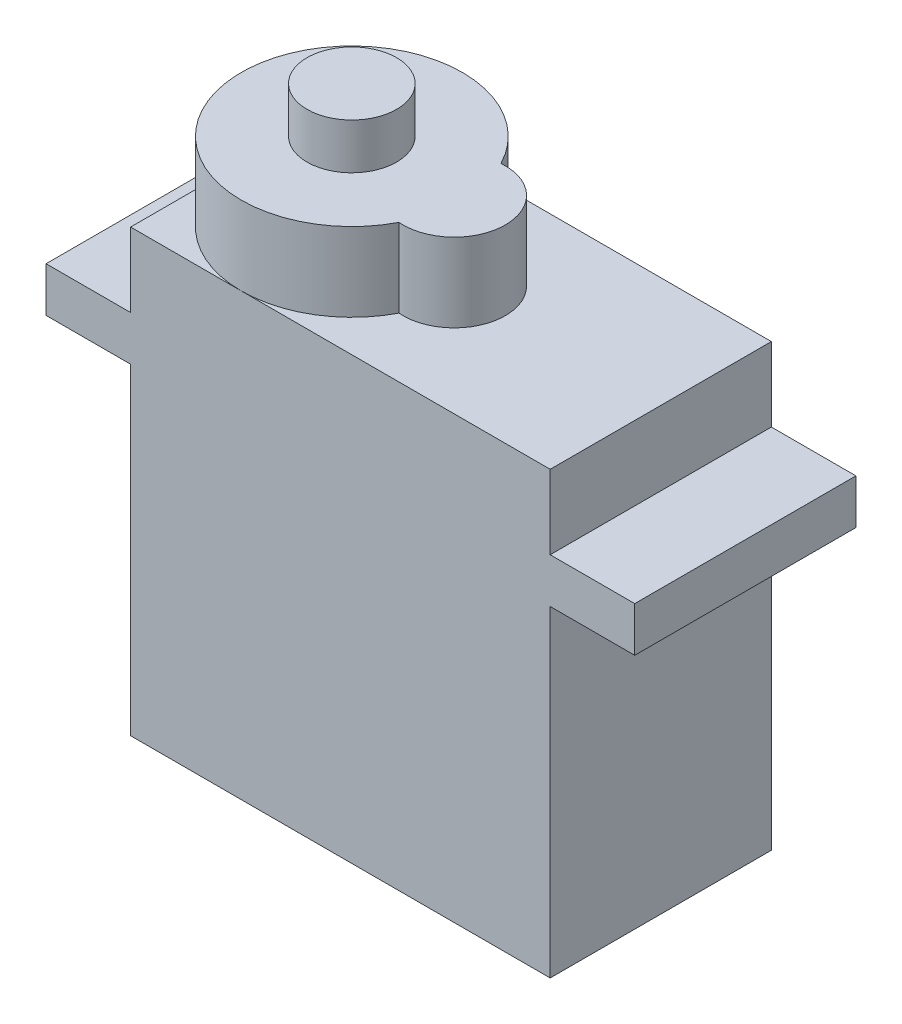
ISO-10303-21;
HEADER;
FILE_DESCRIPTION(('STEP AP214'),'2;1');
FILE_NAME('part.step','',(''),(''),'','','');
FILE_SCHEMA(('AUTOMOTIVE_DESIGN { 1 0 10303 214 1 1 1 1 }'));
ENDSEC;
DATA;
#1=APPLICATION_CONTEXT('core data for automotive mechanical design processes');
#2=APPLICATION_PROTOCOL_DEFINITION('international standard','automotive_design',2000,#1);
#3=PRODUCT_CONTEXT('',#1,'mechanical');
#4=PRODUCT('Part','Part','',(#3));
#5=PRODUCT_RELATED_PRODUCT_CATEGORY('part','',(#4));
#6=PRODUCT_DEFINITION_FORMATION('','',#4);
#7=PRODUCT_DEFINITION_CONTEXT('part definition',#1,'design');
#8=PRODUCT_DEFINITION('design','',#6,#7);
#9=PRODUCT_DEFINITION_SHAPE('','',#8);
#10=(LENGTH_UNIT() NAMED_UNIT(*) SI_UNIT(.MILLI.,.METRE.));
#11=(NAMED_UNIT(*) PLANE_ANGLE_UNIT() SI_UNIT($,.RADIAN.));
#12=(NAMED_UNIT(*) SI_UNIT($,.STERADIAN.) SOLID_ANGLE_UNIT());
#13=UNCERTAINTY_MEASURE_WITH_UNIT(LENGTH_MEASURE(1.E-05),#10,'distance_accuracy_value','');
#14=(GEOMETRIC_REPRESENTATION_CONTEXT(3) GLOBAL_UNCERTAINTY_ASSIGNED_CONTEXT((#13)) GLOBAL_UNIT_ASSIGNED_CONTEXT((#10,
#11,#12)) REPRESENTATION_CONTEXT('',''));
#15=CARTESIAN_POINT('',(0.,0.,0.));
#16=DIRECTION('',(0.,0.,1.));
#17=DIRECTION('',(1.,0.,0.));
#18=AXIS2_PLACEMENT_3D('',#15,#16,#17);
#19=CARTESIAN_POINT('',(11.475,24.1,-6.05));
#20=DIRECTION('',(-1.,0.,0.));
#21=DIRECTION('',(0.,0.,1.));
#22=AXIS2_PLACEMENT_3D('',#19,#20,#21);
#23=PLANE('',#22);
#24=DIRECTION('',(0.,0.,1.));
#25=VECTOR('',#24,1.);
#26=CARTESIAN_POINT('',(11.475,20.05,-6.05));
#27=LINE('',#26,#25);
#28=CARTESIAN_POINT('',(11.475,20.05,-6.05));
#29=VERTEX_POINT('',#28);
#30=CARTESIAN_POINT('',(11.475,20.05,6.05));
#31=VERTEX_POINT('',#30);
#32=EDGE_CURVE('E158',#29,#31,#27,.T.);
#33=ORIENTED_EDGE('',*,*,#32,.F.);
#34=DIRECTION('',(0.,-1.,0.));
#35=VECTOR('',#34,1.);
#36=CARTESIAN_POINT('',(11.475,24.1,-6.05));
#37=LINE('',#36,#35);
#38=CARTESIAN_POINT('',(11.475,24.1,-6.05));
#39=VERTEX_POINT('',#38);
#40=EDGE_CURVE('E169',#39,#29,#37,.T.);
#41=ORIENTED_EDGE('',*,*,#40,.F.);
#42=DIRECTION('',(0.,0.,-1.));
#43=VECTOR('',#42,1.);
#44=CARTESIAN_POINT('',(11.475,24.1,-6.05));
#45=LINE('',#44,#43);
#46=CARTESIAN_POINT('',(11.475,24.1,6.05));
#47=VERTEX_POINT('',#46);
#48=EDGE_CURVE('E317',#47,#39,#45,.T.);
#49=ORIENTED_EDGE('',*,*,#48,.F.);
#50=DIRECTION('',(0.,-1.,0.));
#51=VECTOR('',#50,1.);
#52=CARTESIAN_POINT('',(11.475,24.1,6.05));
#53=LINE('',#52,#51);
#54=EDGE_CURVE('E172',#47,#31,#53,.T.);
#55=ORIENTED_EDGE('',*,*,#54,.T.);
#56=EDGE_LOOP('',(#33,#41,#49,#55));
#57=FACE_BOUND('',#56,.T.);
#58=ADVANCED_FACE('F41',(#57),#23,.F.);
#59=CARTESIAN_POINT('',(-11.475,24.1,-6.05));
#60=DIRECTION('',(1.,0.,0.));
#61=DIRECTION('',(0.,0.,-1.));
#62=AXIS2_PLACEMENT_3D('',#59,#60,#61);
#63=PLANE('',#62);
#64=DIRECTION('',(0.,0.,-1.));
#65=VECTOR('',#64,1.);
#66=CARTESIAN_POINT('',(-11.475,20.05,-6.05));
#67=LINE('',#66,#65);
#68=CARTESIAN_POINT('',(-11.475,20.05,6.05));
#69=VERTEX_POINT('',#68);
#70=CARTESIAN_POINT('',(-11.475,20.05,-6.05));
#71=VERTEX_POINT('',#70);
#72=EDGE_CURVE('E173',#69,#71,#67,.T.);
#73=ORIENTED_EDGE('',*,*,#72,.F.);
#74=DIRECTION('',(0.,-1.,0.));
#75=VECTOR('',#74,1.);
#76=CARTESIAN_POINT('',(-11.475,24.1,6.05));
#77=LINE('',#76,#75);
#78=CARTESIAN_POINT('',(-11.475,24.1,6.05));
#79=VERTEX_POINT('',#78);
#80=EDGE_CURVE('E189',#79,#69,#77,.T.);
#81=ORIENTED_EDGE('',*,*,#80,.F.);
#82=DIRECTION('',(0.,0.,1.));
#83=VECTOR('',#82,1.);
#84=CARTESIAN_POINT('',(-11.475,24.1,-6.05));
#85=LINE('',#84,#83);
#86=CARTESIAN_POINT('',(-11.475,24.1,0.));
#87=VERTEX_POINT('',#86);
#88=EDGE_CURVE('E313',#87,#79,#85,.T.);
#89=ORIENTED_EDGE('',*,*,#88,.F.);
#90=CARTESIAN_POINT('',(-11.475,24.1,-6.05));
#91=VERTEX_POINT('',#90);
#92=EDGE_CURVE('E309',#91,#87,#85,.T.);
#93=ORIENTED_EDGE('',*,*,#92,.F.);
#94=DIRECTION('',(0.,-1.,0.));
#95=VECTOR('',#94,1.);
#96=CARTESIAN_POINT('',(-11.475,24.1,-6.05));
#97=LINE('',#96,#95);
#98=EDGE_CURVE('E185',#91,#71,#97,.T.);
#99=ORIENTED_EDGE('',*,*,#98,.T.);
#100=EDGE_LOOP('',(#73,#81,#89,#93,#99));
#101=FACE_BOUND('',#100,.T.);
#102=ADVANCED_FACE('F206',(#101),#63,.F.);
#103=CARTESIAN_POINT('',(0.,24.1,0.));
#104=DIRECTION('',(0.,-1.,0.));
#105=DIRECTION('',(0.,0.,-1.));
#106=AXIS2_PLACEMENT_3D('',#103,#104,#105);
#107=PLANE('',#106);
#108=CARTESIAN_POINT('',(0.174999999999995,24.1,0.));
#109=DIRECTION('',(0.,1.,0.));
#110=DIRECTION('',(0.,0.,1.));
#111=AXIS2_PLACEMENT_3D('',#108,#109,#110);
#112=CIRCLE('',#111,2.8);
#113=CARTESIAN_POINT('',(-0.0569196428571459,24.1,2.79037869818006));
#114=VERTEX_POINT('',#113);
#115=CARTESIAN_POINT('',(-0.0569196428571459,24.1,-2.79037869818005));
#116=VERTEX_POINT('',#115);
#117=EDGE_CURVE('E290',#114,#116,#112,.T.);
#118=ORIENTED_EDGE('',*,*,#117,.F.);
#119=CARTESIAN_POINT('',(-5.425,24.1,0.));
#120=DIRECTION('',(0.,1.,0.));
#121=DIRECTION('',(0.,0.,1.));
#122=AXIS2_PLACEMENT_3D('',#119,#120,#121);
#123=CIRCLE('',#122,6.05);
#124=CARTESIAN_POINT('',(-5.425,24.1,6.05));
#125=VERTEX_POINT('',#124);
#126=EDGE_CURVE('E192',#125,#114,#123,.T.);
#127=ORIENTED_EDGE('',*,*,#126,.F.);
#128=DIRECTION('',(1.,0.,0.));
#129=VECTOR('',#128,1.);
#130=CARTESIAN_POINT('',(11.475,24.1,6.05));
#131=LINE('',#130,#129);
#132=EDGE_CURVE('E312',#125,#47,#131,.T.);
#133=ORIENTED_EDGE('',*,*,#132,.T.);
#134=ORIENTED_EDGE('',*,*,#48,.T.);
#135=DIRECTION('',(-1.,0.,0.));
#136=VECTOR('',#135,1.);
#137=CARTESIAN_POINT('',(11.475,24.1,-6.05));
#138=LINE('',#137,#136);
#139=CARTESIAN_POINT('',(-5.425,24.1,-6.05));
#140=VERTEX_POINT('',#139);
#141=EDGE_CURVE('E180',#39,#140,#138,.T.);
#142=ORIENTED_EDGE('',*,*,#141,.T.);
#143=EDGE_CURVE('E296',#116,#140,#123,.T.);
#144=ORIENTED_EDGE('',*,*,#143,.F.);
#145=EDGE_LOOP('',(#118,#127,#133,#134,#142,#144));
#146=FACE_BOUND('',#145,.T.);
#147=ADVANCED_FACE('F232',(#146),#107,.F.);
#148=EDGE_CURVE('E195',#140,#87,#123,.T.);
#149=ORIENTED_EDGE('',*,*,#148,.F.);
#150=EDGE_CURVE('E319',#140,#91,#138,.T.);
#151=ORIENTED_EDGE('',*,*,#150,.T.);
#152=ORIENTED_EDGE('',*,*,#92,.T.);
#153=EDGE_LOOP('',(#149,#151,#152));
#154=FACE_BOUND('',#153,.T.);
#155=ADVANCED_FACE('F204',(#154),#107,.F.);
#156=CARTESIAN_POINT('',(-11.475,4.,-1.34));
#157=DIRECTION('',(1.,0.,0.));
#158=DIRECTION('',(0.,0.,-1.));
#159=AXIS2_PLACEMENT_3D('',#156,#157,#158);
#160=CIRCLE('',#159,0.65);
#161=CARTESIAN_POINT('',(-11.475,4.,-1.99));
#162=VERTEX_POINT('',#161);
#163=EDGE_CURVE('E11',#162,#162,#160,.F.);
#164=ORIENTED_EDGE('',*,*,#163,.F.);
#165=EDGE_LOOP('',(#164));
#166=FACE_BOUND('',#165,.T.);
#167=CARTESIAN_POINT('',(-11.475,4.,1.34000000000001));
#168=DIRECTION('',(1.,0.,0.));
#169=DIRECTION('',(0.,0.,-1.));
#170=AXIS2_PLACEMENT_3D('',#167,#168,#169);
#171=CIRCLE('',#170,0.65);
#172=CARTESIAN_POINT('',(-11.475,4.,0.690000000000006));
#173=VERTEX_POINT('',#172);
#174=EDGE_CURVE('E49',#173,#173,#171,.F.);
#175=ORIENTED_EDGE('',*,*,#174,.F.);
#176=EDGE_LOOP('',(#175));
#177=FACE_BOUND('',#176,.T.);
#178=CARTESIAN_POINT('',(-11.475,4.,0.));
#179=DIRECTION('',(1.,0.,0.));
#180=DIRECTION('',(0.,0.,-1.));
#181=AXIS2_PLACEMENT_3D('',#178,#179,#180);
#182=CIRCLE('',#181,0.65);
#183=CARTESIAN_POINT('',(-11.475,4.,-0.649999999999999));
#184=VERTEX_POINT('',#183);
#185=EDGE_CURVE('E193',#184,#184,#182,.F.);
#186=ORIENTED_EDGE('',*,*,#185,.F.);
#187=EDGE_LOOP('',(#186));
#188=FACE_BOUND('',#187,.T.);
#189=CARTESIAN_POINT('',(-11.475,17.6,6.05));
#190=VERTEX_POINT('',#189);
#191=CARTESIAN_POINT('',(-11.475,0.,6.05));
#192=VERTEX_POINT('',#191);
#193=EDGE_CURVE('E64',#190,#192,#77,.T.);
#194=ORIENTED_EDGE('',*,*,#193,.F.);
#195=DIRECTION('',(0.,0.,-1.));
#196=VECTOR('',#195,1.);
#197=CARTESIAN_POINT('',(-11.475,17.6,-6.05));
#198=LINE('',#197,#196);
#199=CARTESIAN_POINT('',(-11.475,17.6,-6.05));
#200=VERTEX_POINT('',#199);
#201=EDGE_CURVE('E265',#190,#200,#198,.T.);
#202=ORIENTED_EDGE('',*,*,#201,.T.);
#203=CARTESIAN_POINT('',(-11.475,0.,-6.05));
#204=VERTEX_POINT('',#203);
#205=EDGE_CURVE('E321',#200,#204,#97,.T.);
#206=ORIENTED_EDGE('',*,*,#205,.T.);
#207=DIRECTION('',(0.,0.,1.));
#208=VECTOR('',#207,1.);
#209=CARTESIAN_POINT('',(-11.475,0.,-6.05));
#210=LINE('',#209,#208);
#211=EDGE_CURVE('E308',#204,#192,#210,.T.);
#212=ORIENTED_EDGE('',*,*,#211,.T.);
#213=EDGE_LOOP('',(#194,#202,#206,#212));
#214=FACE_BOUND('',#213,.T.);
#215=ADVANCED_FACE('F43',(#166,#177,#188,#214),#63,.F.);
#216=CARTESIAN_POINT('',(11.475,24.1,6.05));
#217=DIRECTION('',(0.,0.,-1.));
#218=DIRECTION('',(-1.,0.,0.));
#219=AXIS2_PLACEMENT_3D('',#216,#217,#218);
#220=PLANE('',#219);
#221=DIRECTION('',(1.,0.,0.));
#222=VECTOR('',#221,1.);
#223=CARTESIAN_POINT('',(11.475,0.,6.05));
#224=LINE('',#223,#222);
#225=CARTESIAN_POINT('',(11.475,0.,6.05));
#226=VERTEX_POINT('',#225);
#227=EDGE_CURVE('E323',#192,#226,#224,.T.);
#228=ORIENTED_EDGE('',*,*,#227,.T.);
#229=CARTESIAN_POINT('',(11.475,17.6,6.05));
#230=VERTEX_POINT('',#229);
#231=EDGE_CURVE('E181',#230,#226,#53,.T.);
#232=ORIENTED_EDGE('',*,*,#231,.F.);
#233=DIRECTION('',(1.,0.,0.));
#234=VECTOR('',#233,1.);
#235=CARTESIAN_POINT('',(11.475,17.6,6.05));
#236=LINE('',#235,#234);
#237=CARTESIAN_POINT('',(16.1,17.6,6.05));
#238=VERTEX_POINT('',#237);
#239=EDGE_CURVE('E56',#230,#238,#236,.T.);
#240=ORIENTED_EDGE('',*,*,#239,.T.);
#241=DIRECTION('',(0.,1.,0.));
#242=VECTOR('',#241,1.);
#243=CARTESIAN_POINT('',(16.1,17.6,6.05));
#244=LINE('',#243,#242);
#245=CARTESIAN_POINT('',(16.1,20.05,6.05));
#246=VERTEX_POINT('',#245);
#247=EDGE_CURVE('E257',#238,#246,#244,.T.);
#248=ORIENTED_EDGE('',*,*,#247,.T.);
#249=DIRECTION('',(1.,0.,0.));
#250=VECTOR('',#249,1.);
#251=CARTESIAN_POINT('',(11.475,20.05,6.05));
#252=LINE('',#251,#250);
#253=EDGE_CURVE('E174',#31,#246,#252,.T.);
#254=ORIENTED_EDGE('',*,*,#253,.F.);
#255=ORIENTED_EDGE('',*,*,#54,.F.);
#256=ORIENTED_EDGE('',*,*,#132,.F.);
#257=EDGE_CURVE('E314',#79,#125,#131,.T.);
#258=ORIENTED_EDGE('',*,*,#257,.F.);
#259=ORIENTED_EDGE('',*,*,#80,.T.);
#260=DIRECTION('',(1.,0.,0.));
#261=VECTOR('',#260,1.);
#262=CARTESIAN_POINT('',(-11.475,20.05,6.05));
#263=LINE('',#262,#261);
#264=CARTESIAN_POINT('',(-16.1,20.05,6.05));
#265=VERTEX_POINT('',#264);
#266=EDGE_CURVE('E268',#265,#69,#263,.T.);
#267=ORIENTED_EDGE('',*,*,#266,.F.);
#268=DIRECTION('',(0.,1.,0.));
#269=VECTOR('',#268,1.);
#270=CARTESIAN_POINT('',(-16.1,17.6,6.05));
#271=LINE('',#270,#269);
#272=CARTESIAN_POINT('',(-16.1,17.6,6.05));
#273=VERTEX_POINT('',#272);
#274=EDGE_CURVE('E288',#273,#265,#271,.T.);
#275=ORIENTED_EDGE('',*,*,#274,.F.);
#276=DIRECTION('',(1.,0.,0.));
#277=VECTOR('',#276,1.);
#278=CARTESIAN_POINT('',(-11.475,17.6,6.05));
#279=LINE('',#278,#277);
#280=EDGE_CURVE('E274',#273,#190,#279,.T.);
#281=ORIENTED_EDGE('',*,*,#280,.T.);
#282=ORIENTED_EDGE('',*,*,#193,.T.);
#283=EDGE_LOOP('',(#228,#232,#240,#248,#254,#255,#256,#258,#259,#267,#275,#281,#282));
#284=FACE_BOUND('',#283,.T.);
#285=ADVANCED_FACE('F203',(#284),#220,.F.);
#286=CARTESIAN_POINT('',(11.475,17.6,-6.05));
#287=VERTEX_POINT('',#286);
#288=CARTESIAN_POINT('',(11.475,0.,-6.05));
#289=VERTEX_POINT('',#288);
#290=EDGE_CURVE('E182',#287,#289,#37,.T.);
#291=ORIENTED_EDGE('',*,*,#290,.F.);
#292=DIRECTION('',(0.,0.,1.));
#293=VECTOR('',#292,1.);
#294=CARTESIAN_POINT('',(11.475,17.6,-6.05));
#295=LINE('',#294,#293);
#296=EDGE_CURVE('E164',#287,#230,#295,.T.);
#297=ORIENTED_EDGE('',*,*,#296,.T.);
#298=ORIENTED_EDGE('',*,*,#231,.T.);
#299=DIRECTION('',(0.,0.,-1.));
#300=VECTOR('',#299,1.);
#301=CARTESIAN_POINT('',(11.475,0.,-6.05));
#302=LINE('',#301,#300);
#303=EDGE_CURVE('E247',#226,#289,#302,.T.);
#304=ORIENTED_EDGE('',*,*,#303,.T.);
#305=EDGE_LOOP('',(#291,#297,#298,#304));
#306=FACE_BOUND('',#305,.T.);
#307=ADVANCED_FACE('F227',(#306),#23,.F.);
#308=CARTESIAN_POINT('',(11.475,24.1,-6.05));
#309=DIRECTION('',(0.,0.,1.));
#310=DIRECTION('',(1.,0.,0.));
#311=AXIS2_PLACEMENT_3D('',#308,#309,#310);
#312=PLANE('',#311);
#313=DIRECTION('',(-1.,0.,0.));
#314=VECTOR('',#313,1.);
#315=CARTESIAN_POINT('',(11.475,0.,-6.05));
#316=LINE('',#315,#314);
#317=EDGE_CURVE('E250',#289,#204,#316,.T.);
#318=ORIENTED_EDGE('',*,*,#317,.T.);
#319=ORIENTED_EDGE('',*,*,#205,.F.);
#320=DIRECTION('',(-1.,0.,0.));
#321=VECTOR('',#320,1.);
#322=CARTESIAN_POINT('',(-11.475,17.6,-6.05));
#323=LINE('',#322,#321);
#324=CARTESIAN_POINT('',(-16.1,17.6,-6.05));
#325=VERTEX_POINT('',#324);
#326=EDGE_CURVE('E267',#200,#325,#323,.T.);
#327=ORIENTED_EDGE('',*,*,#326,.T.);
#328=DIRECTION('',(0.,1.,0.));
#329=VECTOR('',#328,1.);
#330=CARTESIAN_POINT('',(-16.1,17.6,-6.05));
#331=LINE('',#330,#329);
#332=CARTESIAN_POINT('',(-16.1,20.05,-6.05));
#333=VERTEX_POINT('',#332);
#334=EDGE_CURVE('E277',#325,#333,#331,.T.);
#335=ORIENTED_EDGE('',*,*,#334,.T.);
#336=DIRECTION('',(-1.,0.,0.));
#337=VECTOR('',#336,1.);
#338=CARTESIAN_POINT('',(-11.475,20.05,-6.05));
#339=LINE('',#338,#337);
#340=EDGE_CURVE('E280',#71,#333,#339,.T.);
#341=ORIENTED_EDGE('',*,*,#340,.F.);
#342=ORIENTED_EDGE('',*,*,#98,.F.);
#343=ORIENTED_EDGE('',*,*,#150,.F.);
#344=ORIENTED_EDGE('',*,*,#141,.F.);
#345=ORIENTED_EDGE('',*,*,#40,.T.);
#346=DIRECTION('',(-1.,0.,0.));
#347=VECTOR('',#346,1.);
#348=CARTESIAN_POINT('',(11.475,20.05,-6.05));
#349=LINE('',#348,#347);
#350=CARTESIAN_POINT('',(16.1,20.05,-6.05));
#351=VERTEX_POINT('',#350);
#352=EDGE_CURVE('E154',#351,#29,#349,.T.);
#353=ORIENTED_EDGE('',*,*,#352,.F.);
#354=DIRECTION('',(0.,1.,0.));
#355=VECTOR('',#354,1.);
#356=CARTESIAN_POINT('',(16.1,17.6,-6.05));
#357=LINE('',#356,#355);
#358=CARTESIAN_POINT('',(16.1,17.6,-6.05));
#359=VERTEX_POINT('',#358);
#360=EDGE_CURVE('E254',#359,#351,#357,.T.);
#361=ORIENTED_EDGE('',*,*,#360,.F.);
#362=DIRECTION('',(-1.,0.,0.));
#363=VECTOR('',#362,1.);
#364=CARTESIAN_POINT('',(11.475,17.6,-6.05));
#365=LINE('',#364,#363);
#366=EDGE_CURVE('E253',#359,#287,#365,.T.);
#367=ORIENTED_EDGE('',*,*,#366,.T.);
#368=ORIENTED_EDGE('',*,*,#290,.T.);
#369=EDGE_LOOP('',(#318,#319,#327,#335,#341,#342,#343,#344,#345,#353,#361,#367,#368));
#370=FACE_BOUND('',#369,.T.);
#371=ADVANCED_FACE('F177',(#370),#312,.F.);
#372=EDGE_CURVE('E330',#87,#125,#123,.T.);
#373=ORIENTED_EDGE('',*,*,#372,.F.);
#374=ORIENTED_EDGE('',*,*,#88,.T.);
#375=ORIENTED_EDGE('',*,*,#257,.T.);
#376=EDGE_LOOP('',(#373,#374,#375));
#377=FACE_BOUND('',#376,.T.);
#378=ADVANCED_FACE('F241',(#377),#107,.F.);
#379=CARTESIAN_POINT('',(0.,0.,0.));
#380=DIRECTION('',(0.,-1.,0.));
#381=DIRECTION('',(0.,0.,-1.));
#382=AXIS2_PLACEMENT_3D('',#379,#380,#381);
#383=PLANE('',#382);
#384=ORIENTED_EDGE('',*,*,#211,.F.);
#385=ORIENTED_EDGE('',*,*,#317,.F.);
#386=ORIENTED_EDGE('',*,*,#303,.F.);
#387=ORIENTED_EDGE('',*,*,#227,.F.);
#388=EDGE_LOOP('',(#384,#385,#386,#387));
#389=FACE_BOUND('',#388,.T.);
#390=ADVANCED_FACE('F375',(#389),#383,.T.);
#391=CARTESIAN_POINT('',(0.174999999999995,28.4,0.));
#392=DIRECTION('',(0.,-1.,0.));
#393=DIRECTION('',(0.,0.,-1.));
#394=AXIS2_PLACEMENT_3D('',#391,#392,#393);
#395=CYLINDRICAL_SURFACE('',#394,2.8);
#396=ORIENTED_EDGE('',*,*,#117,.T.);
#397=DIRECTION('',(0.,-1.,0.));
#398=VECTOR('',#397,1.);
#399=CARTESIAN_POINT('',(-0.0569196428571459,28.4,-2.79037869818005));
#400=LINE('',#399,#398);
#401=CARTESIAN_POINT('',(-0.0569196428571459,28.4,-2.79037869818005));
#402=VERTEX_POINT('',#401);
#403=EDGE_CURVE('E305',#402,#116,#400,.T.);
#404=ORIENTED_EDGE('',*,*,#403,.F.);
#405=CARTESIAN_POINT('',(0.174999999999995,28.4,0.));
#406=DIRECTION('',(0.,1.,0.));
#407=DIRECTION('',(0.,0.,1.));
#408=AXIS2_PLACEMENT_3D('',#405,#406,#407);
#409=CIRCLE('',#408,2.8);
#410=CARTESIAN_POINT('',(-0.0569196428571459,28.4,2.79037869818006));
#411=VERTEX_POINT('',#410);
#412=EDGE_CURVE('E292',#411,#402,#409,.T.);
#413=ORIENTED_EDGE('',*,*,#412,.F.);
#414=DIRECTION('',(0.,-1.,0.));
#415=VECTOR('',#414,1.);
#416=CARTESIAN_POINT('',(-0.0569196428571459,28.4,2.79037869818006));
#417=LINE('',#416,#415);
#418=EDGE_CURVE('E298',#411,#114,#417,.T.);
#419=ORIENTED_EDGE('',*,*,#418,.T.);
#420=EDGE_LOOP('',(#396,#404,#413,#419));
#421=FACE_BOUND('',#420,.T.);
#422=ADVANCED_FACE('F356',(#421),#395,.T.);
#423=CARTESIAN_POINT('',(-5.425,28.4,0.));
#424=DIRECTION('',(0.,-1.,0.));
#425=DIRECTION('',(0.,0.,-1.));
#426=AXIS2_PLACEMENT_3D('',#423,#424,#425);
#427=CYLINDRICAL_SURFACE('',#426,6.05);
#428=ORIENTED_EDGE('',*,*,#143,.T.);
#429=ORIENTED_EDGE('',*,*,#148,.T.);
#430=ORIENTED_EDGE('',*,*,#372,.T.);
#431=ORIENTED_EDGE('',*,*,#126,.T.);
#432=ORIENTED_EDGE('',*,*,#418,.F.);
#433=CARTESIAN_POINT('',(-5.425,28.4,0.));
#434=DIRECTION('',(0.,1.,0.));
#435=DIRECTION('',(0.,0.,1.));
#436=AXIS2_PLACEMENT_3D('',#433,#434,#435);
#437=CIRCLE('',#436,6.05);
#438=EDGE_CURVE('E295',#402,#411,#437,.T.);
#439=ORIENTED_EDGE('',*,*,#438,.F.);
#440=ORIENTED_EDGE('',*,*,#403,.T.);
#441=EDGE_LOOP('',(#428,#429,#430,#431,#432,#439,#440));
#442=FACE_BOUND('',#441,.T.);
#443=ADVANCED_FACE('F350',(#442),#427,.T.);
#444=CARTESIAN_POINT('',(-2.625,28.4,0.));
#445=DIRECTION('',(0.,1.,0.));
#446=DIRECTION('',(0.,0.,1.));
#447=AXIS2_PLACEMENT_3D('',#444,#445,#446);
#448=PLANE('',#447);
#449=CARTESIAN_POINT('',(-5.425,28.4,0.));
#450=DIRECTION('',(0.,1.,0.));
#451=DIRECTION('',(0.,0.,1.));
#452=AXIS2_PLACEMENT_3D('',#449,#450,#451);
#453=CIRCLE('',#452,2.45);
#454=CARTESIAN_POINT('',(-5.425,28.4,2.45));
#455=VERTEX_POINT('',#454);
#456=EDGE_CURVE('E390',#455,#455,#453,.T.);
#457=ORIENTED_EDGE('',*,*,#456,.F.);
#458=EDGE_LOOP('',(#457));
#459=FACE_BOUND('',#458,.T.);
#460=ORIENTED_EDGE('',*,*,#412,.T.);
#461=ORIENTED_EDGE('',*,*,#438,.T.);
#462=EDGE_LOOP('',(#460,#461));
#463=FACE_BOUND('',#462,.T.);
#464=ADVANCED_FACE('F359',(#459,#463),#448,.T.);
#465=CARTESIAN_POINT('',(-16.1,17.6,-6.05));
#466=DIRECTION('',(-1.,0.,0.));
#467=DIRECTION('',(0.,0.,1.));
#468=AXIS2_PLACEMENT_3D('',#465,#466,#467);
#469=PLANE('',#468);
#470=DIRECTION('',(0.,0.,1.));
#471=VECTOR('',#470,1.);
#472=CARTESIAN_POINT('',(-16.1,20.05,-6.05));
#473=LINE('',#472,#471);
#474=EDGE_CURVE('E283',#333,#265,#473,.T.);
#475=ORIENTED_EDGE('',*,*,#474,.F.);
#476=ORIENTED_EDGE('',*,*,#334,.F.);
#477=DIRECTION('',(0.,0.,1.));
#478=VECTOR('',#477,1.);
#479=CARTESIAN_POINT('',(-16.1,17.6,-6.05));
#480=LINE('',#479,#478);
#481=EDGE_CURVE('E271',#325,#273,#480,.T.);
#482=ORIENTED_EDGE('',*,*,#481,.T.);
#483=ORIENTED_EDGE('',*,*,#274,.T.);
#484=EDGE_LOOP('',(#475,#476,#482,#483));
#485=FACE_BOUND('',#484,.T.);
#486=ADVANCED_FACE('F343',(#485),#469,.T.);
#487=CARTESIAN_POINT('',(0.,17.6,0.));
#488=DIRECTION('',(0.,-1.,0.));
#489=DIRECTION('',(0.,0.,-1.));
#490=AXIS2_PLACEMENT_3D('',#487,#488,#489);
#491=PLANE('',#490);
#492=ORIENTED_EDGE('',*,*,#201,.F.);
#493=ORIENTED_EDGE('',*,*,#280,.F.);
#494=ORIENTED_EDGE('',*,*,#481,.F.);
#495=ORIENTED_EDGE('',*,*,#326,.F.);
#496=EDGE_LOOP('',(#492,#493,#494,#495));
#497=FACE_BOUND('',#496,.T.);
#498=ADVANCED_FACE('F346',(#497),#491,.T.);
#499=CARTESIAN_POINT('',(0.,20.05,0.));
#500=DIRECTION('',(0.,-1.,0.));
#501=DIRECTION('',(0.,0.,-1.));
#502=AXIS2_PLACEMENT_3D('',#499,#500,#501);
#503=PLANE('',#502);
#504=ORIENTED_EDGE('',*,*,#72,.T.);
#505=ORIENTED_EDGE('',*,*,#340,.T.);
#506=ORIENTED_EDGE('',*,*,#474,.T.);
#507=ORIENTED_EDGE('',*,*,#266,.T.);
#508=EDGE_LOOP('',(#504,#505,#506,#507));
#509=FACE_BOUND('',#508,.T.);
#510=ADVANCED_FACE('F338',(#509),#503,.F.);
#511=CARTESIAN_POINT('',(16.1,17.6,-6.05));
#512=DIRECTION('',(1.,0.,0.));
#513=DIRECTION('',(0.,0.,-1.));
#514=AXIS2_PLACEMENT_3D('',#511,#512,#513);
#515=PLANE('',#514);
#516=DIRECTION('',(0.,0.,-1.));
#517=VECTOR('',#516,1.);
#518=CARTESIAN_POINT('',(16.1,20.05,-6.05));
#519=LINE('',#518,#517);
#520=EDGE_CURVE('E161',#246,#351,#519,.T.);
#521=ORIENTED_EDGE('',*,*,#520,.F.);
#522=ORIENTED_EDGE('',*,*,#247,.F.);
#523=DIRECTION('',(0.,0.,-1.));
#524=VECTOR('',#523,1.);
#525=CARTESIAN_POINT('',(16.1,17.6,-6.05));
#526=LINE('',#525,#524);
#527=EDGE_CURVE('E256',#238,#359,#526,.T.);
#528=ORIENTED_EDGE('',*,*,#527,.T.);
#529=ORIENTED_EDGE('',*,*,#360,.T.);
#530=EDGE_LOOP('',(#521,#522,#528,#529));
#531=FACE_BOUND('',#530,.T.);
#532=ADVANCED_FACE('F385',(#531),#515,.T.);
#533=CARTESIAN_POINT('',(0.,17.6,0.));
#534=DIRECTION('',(0.,1.,0.));
#535=DIRECTION('',(0.,0.,1.));
#536=AXIS2_PLACEMENT_3D('',#533,#534,#535);
#537=PLANE('',#536);
#538=ORIENTED_EDGE('',*,*,#296,.F.);
#539=ORIENTED_EDGE('',*,*,#366,.F.);
#540=ORIENTED_EDGE('',*,*,#527,.F.);
#541=ORIENTED_EDGE('',*,*,#239,.F.);
#542=EDGE_LOOP('',(#538,#539,#540,#541));
#543=FACE_BOUND('',#542,.T.);
#544=ADVANCED_FACE('F472',(#543),#537,.F.);
#545=CARTESIAN_POINT('',(0.,20.05,0.));
#546=DIRECTION('',(0.,1.,0.));
#547=DIRECTION('',(0.,0.,1.));
#548=AXIS2_PLACEMENT_3D('',#545,#546,#547);
#549=PLANE('',#548);
#550=ORIENTED_EDGE('',*,*,#32,.T.);
#551=ORIENTED_EDGE('',*,*,#253,.T.);
#552=ORIENTED_EDGE('',*,*,#520,.T.);
#553=ORIENTED_EDGE('',*,*,#352,.T.);
#554=EDGE_LOOP('',(#550,#551,#552,#553));
#555=FACE_BOUND('',#554,.T.);
#556=ADVANCED_FACE('F156',(#555),#549,.T.);
#557=CARTESIAN_POINT('',(-5.425,30.9,0.));
#558=DIRECTION('',(0.,-1.,0.));
#559=DIRECTION('',(0.,0.,-1.));
#560=AXIS2_PLACEMENT_3D('',#557,#558,#559);
#561=CYLINDRICAL_SURFACE('',#560,2.45);
#562=CARTESIAN_POINT('',(-5.425,30.9,0.));
#563=DIRECTION('',(0.,1.,0.));
#564=DIRECTION('',(0.,0.,1.));
#565=AXIS2_PLACEMENT_3D('',#562,#563,#564);
#566=CIRCLE('',#565,2.45);
#567=CARTESIAN_POINT('',(-5.425,30.9,2.45));
#568=VERTEX_POINT('',#567);
#569=EDGE_CURVE('E388',#568,#568,#566,.T.);
#570=ORIENTED_EDGE('',*,*,#569,.F.);
#571=EDGE_LOOP('',(#570));
#572=FACE_BOUND('',#571,.T.);
#573=ORIENTED_EDGE('',*,*,#456,.T.);
#574=EDGE_LOOP('',(#573));
#575=FACE_BOUND('',#574,.T.);
#576=ADVANCED_FACE('F221',(#572,#575),#561,.T.);
#577=CARTESIAN_POINT('',(-5.425,30.9,0.));
#578=DIRECTION('',(0.,1.,0.));
#579=DIRECTION('',(0.,0.,1.));
#580=AXIS2_PLACEMENT_3D('',#577,#578,#579);
#581=PLANE('',#580);
#582=ORIENTED_EDGE('',*,*,#569,.T.);
#583=EDGE_LOOP('',(#582));
#584=FACE_BOUND('',#583,.T.);
#585=ADVANCED_FACE('F212',(#584),#581,.T.);
#586=CARTESIAN_POINT('',(-15.375,4.,0.));
#587=DIRECTION('',(1.,0.,0.));
#588=DIRECTION('',(0.,0.,-1.));
#589=AXIS2_PLACEMENT_3D('',#586,#587,#588);
#590=CYLINDRICAL_SURFACE('',#589,0.65);
#591=CARTESIAN_POINT('',(-15.375,4.,0.));
#592=DIRECTION('',(-1.,0.,0.));
#593=DIRECTION('',(0.,0.,1.));
#594=AXIS2_PLACEMENT_3D('',#591,#592,#593);
#595=CIRCLE('',#594,0.65);
#596=CARTESIAN_POINT('',(-15.375,4.,0.650000000000002));
#597=VERTEX_POINT('',#596);
#598=EDGE_CURVE('E393',#597,#597,#595,.T.);
#599=ORIENTED_EDGE('',*,*,#598,.F.);
#600=EDGE_LOOP('',(#599));
#601=FACE_BOUND('',#600,.T.);
#602=ORIENTED_EDGE('',*,*,#185,.T.);
#603=EDGE_LOOP('',(#602));
#604=FACE_BOUND('',#603,.T.);
#605=ADVANCED_FACE('F209',(#601,#604),#590,.T.);
#606=CARTESIAN_POINT('',(-15.375,4.,0.));
#607=DIRECTION('',(-1.,0.,0.));
#608=DIRECTION('',(0.,0.,1.));
#609=AXIS2_PLACEMENT_3D('',#606,#607,#608);
#610=PLANE('',#609);
#611=ORIENTED_EDGE('',*,*,#598,.T.);
#612=EDGE_LOOP('',(#611));
#613=FACE_BOUND('',#612,.T.);
#614=ADVANCED_FACE('F211',(#613),#610,.T.);
#615=CARTESIAN_POINT('',(-15.375,4.,1.34000000000001));
#616=DIRECTION('',(1.,0.,0.));
#617=DIRECTION('',(0.,0.,-1.));
#618=AXIS2_PLACEMENT_3D('',#615,#616,#617);
#619=CYLINDRICAL_SURFACE('',#618,0.65);
#620=CARTESIAN_POINT('',(-15.375,4.,1.34000000000001));
#621=DIRECTION('',(-1.,0.,0.));
#622=DIRECTION('',(0.,0.,1.));
#623=AXIS2_PLACEMENT_3D('',#620,#621,#622);
#624=CIRCLE('',#623,0.65);
#625=CARTESIAN_POINT('',(-15.375,4.,1.99000000000001));
#626=VERTEX_POINT('',#625);
#627=EDGE_CURVE('E398',#626,#626,#624,.T.);
#628=ORIENTED_EDGE('',*,*,#627,.F.);
#629=EDGE_LOOP('',(#628));
#630=FACE_BOUND('',#629,.T.);
#631=ORIENTED_EDGE('',*,*,#174,.T.);
#632=EDGE_LOOP('',(#631));
#633=FACE_BOUND('',#632,.T.);
#634=ADVANCED_FACE('F199',(#630,#633),#619,.T.);
#635=CARTESIAN_POINT('',(-15.375,4.,1.34000000000001));
#636=DIRECTION('',(-1.,0.,0.));
#637=DIRECTION('',(0.,0.,1.));
#638=AXIS2_PLACEMENT_3D('',#635,#636,#637);
#639=PLANE('',#638);
#640=ORIENTED_EDGE('',*,*,#627,.T.);
#641=EDGE_LOOP('',(#640));
#642=FACE_BOUND('',#641,.T.);
#643=ADVANCED_FACE('F410',(#642),#639,.T.);
#644=CARTESIAN_POINT('',(-15.375,4.,-1.34));
#645=DIRECTION('',(1.,0.,0.));
#646=DIRECTION('',(0.,0.,-1.));
#647=AXIS2_PLACEMENT_3D('',#644,#645,#646);
#648=CYLINDRICAL_SURFACE('',#647,0.65);
#649=CARTESIAN_POINT('',(-15.375,4.,-1.34));
#650=DIRECTION('',(-1.,0.,0.));
#651=DIRECTION('',(0.,0.,-1.));
#652=AXIS2_PLACEMENT_3D('',#649,#650,#651);
#653=CIRCLE('',#652,0.65);
#654=CARTESIAN_POINT('',(-15.375,4.,-1.99));
#655=VERTEX_POINT('',#654);
#656=EDGE_CURVE('E401',#655,#655,#653,.T.);
#657=ORIENTED_EDGE('',*,*,#656,.F.);
#658=EDGE_LOOP('',(#657));
#659=FACE_BOUND('',#658,.T.);
#660=ORIENTED_EDGE('',*,*,#163,.T.);
#661=EDGE_LOOP('',(#660));
#662=FACE_BOUND('',#661,.T.);
#663=ADVANCED_FACE('F407',(#659,#662),#648,.T.);
#664=CARTESIAN_POINT('',(-15.375,4.,-1.34));
#665=DIRECTION('',(1.,0.,0.));
#666=DIRECTION('',(0.,0.,-1.));
#667=AXIS2_PLACEMENT_3D('',#664,#665,#666);
#668=PLANE('',#667);
#669=ORIENTED_EDGE('',*,*,#656,.T.);
#670=EDGE_LOOP('',(#669));
#671=FACE_BOUND('',#670,.T.);
#672=ADVANCED_FACE('F405',(#671),#668,.F.);
#673=CLOSED_SHELL('',(#58,#102,#147,#155,#215,#285,#307,#371,#378,#390,#422,#443,#464,#486,#498,
#510,#532,#544,#556,#576,#585,#605,#614,#634,#643,#663,#672));
#674=MANIFOLD_SOLID_BREP('B2',#673);
#675=ADVANCED_BREP_SHAPE_REPRESENTATION('',(#18,#674),#14);
#676=SHAPE_DEFINITION_REPRESENTATION(#9,#675);
ENDSEC;
END-ISO-10303-21;
